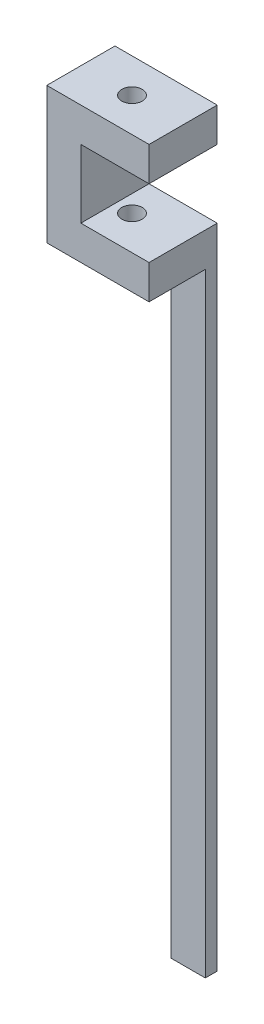
ISO-10303-21;
HEADER;
FILE_DESCRIPTION(('STEP AP214'),'2;1');
FILE_NAME('part.step','',(''),(''),'','','');
FILE_SCHEMA(('AUTOMOTIVE_DESIGN { 1 0 10303 214 1 1 1 1 }'));
ENDSEC;
DATA;
#1=APPLICATION_CONTEXT('core data for automotive mechanical design processes');
#2=APPLICATION_PROTOCOL_DEFINITION('international standard','automotive_design',2000,#1);
#3=PRODUCT_CONTEXT('',#1,'mechanical');
#4=PRODUCT('Part','Part','',(#3));
#5=PRODUCT_RELATED_PRODUCT_CATEGORY('part','',(#4));
#6=PRODUCT_DEFINITION_FORMATION('','',#4);
#7=PRODUCT_DEFINITION_CONTEXT('part definition',#1,'design');
#8=PRODUCT_DEFINITION('design','',#6,#7);
#9=PRODUCT_DEFINITION_SHAPE('','',#8);
#10=(LENGTH_UNIT() NAMED_UNIT(*) SI_UNIT(.MILLI.,.METRE.));
#11=(NAMED_UNIT(*) PLANE_ANGLE_UNIT() SI_UNIT($,.RADIAN.));
#12=(NAMED_UNIT(*) SI_UNIT($,.STERADIAN.) SOLID_ANGLE_UNIT());
#13=UNCERTAINTY_MEASURE_WITH_UNIT(LENGTH_MEASURE(1.E-05),#10,'distance_accuracy_value','');
#14=(GEOMETRIC_REPRESENTATION_CONTEXT(3) GLOBAL_UNCERTAINTY_ASSIGNED_CONTEXT((#13)) GLOBAL_UNIT_ASSIGNED_CONTEXT((#10,
#11,#12)) REPRESENTATION_CONTEXT('',''));
#15=CARTESIAN_POINT('',(0.,0.,0.));
#16=DIRECTION('',(0.,0.,1.));
#17=DIRECTION('',(1.,0.,0.));
#18=AXIS2_PLACEMENT_3D('',#15,#16,#17);
#19=CARTESIAN_POINT('',(0.,-9.18809518970519,10.));
#20=DIRECTION('',(0.,1.,0.));
#21=DIRECTION('',(0.,0.,1.));
#22=AXIS2_PLACEMENT_3D('',#19,#20,#21);
#23=PLANE('',#22);
#24=CARTESIAN_POINT('',(7.5,-9.18809518970519,5.));
#25=DIRECTION('',(0.,1.,0.));
#26=DIRECTION('',(0.,0.,1.));
#27=AXIS2_PLACEMENT_3D('',#24,#25,#26);
#28=CIRCLE('',#27,1.5);
#29=CARTESIAN_POINT('',(7.5,-9.18809518970519,6.5));
#30=VERTEX_POINT('',#29);
#31=EDGE_CURVE('E248',#30,#30,#28,.T.);
#32=ORIENTED_EDGE('',*,*,#31,.T.);
#33=EDGE_LOOP('',(#32));
#34=FACE_BOUND('',#33,.T.);
#35=DIRECTION('',(0.,0.,-1.));
#36=VECTOR('',#35,1.);
#37=CARTESIAN_POINT('',(10.,-9.18809518970519,0.));
#38=LINE('',#37,#36);
#39=CARTESIAN_POINT('',(10.,-9.18809518970519,1.75));
#40=VERTEX_POINT('',#39);
#41=CARTESIAN_POINT('',(10.,-9.18809518970519,0.));
#42=VERTEX_POINT('',#41);
#43=EDGE_CURVE('E148',#40,#42,#38,.T.);
#44=ORIENTED_EDGE('',*,*,#43,.F.);
#45=DIRECTION('',(-1.,0.,0.));
#46=VECTOR('',#45,1.);
#47=CARTESIAN_POINT('',(15.,-9.18809518970519,1.75));
#48=LINE('',#47,#46);
#49=CARTESIAN_POINT('',(15.,-9.18809518970519,1.75));
#50=VERTEX_POINT('',#49);
#51=EDGE_CURVE('E59',#50,#40,#48,.T.);
#52=ORIENTED_EDGE('',*,*,#51,.F.);
#53=DIRECTION('',(0.,0.,-1.));
#54=VECTOR('',#53,1.);
#55=CARTESIAN_POINT('',(15.,-9.18809518970519,10.));
#56=LINE('',#55,#54);
#57=CARTESIAN_POINT('',(15.,-9.18809518970519,10.));
#58=VERTEX_POINT('',#57);
#59=EDGE_CURVE('E152',#58,#50,#56,.T.);
#60=ORIENTED_EDGE('',*,*,#59,.F.);
#61=DIRECTION('',(1.,0.,0.));
#62=VECTOR('',#61,1.);
#63=CARTESIAN_POINT('',(0.,-9.18809518970519,10.));
#64=LINE('',#63,#62);
#65=CARTESIAN_POINT('',(0.,-9.18809518970519,10.));
#66=VERTEX_POINT('',#65);
#67=EDGE_CURVE('E173',#66,#58,#64,.T.);
#68=ORIENTED_EDGE('',*,*,#67,.F.);
#69=DIRECTION('',(0.,0.,-1.));
#70=VECTOR('',#69,1.);
#71=CARTESIAN_POINT('',(0.,-9.18809518970519,10.));
#72=LINE('',#71,#70);
#73=CARTESIAN_POINT('',(0.,-9.18809518970519,0.));
#74=VERTEX_POINT('',#73);
#75=EDGE_CURVE('E52',#66,#74,#72,.T.);
#76=ORIENTED_EDGE('',*,*,#75,.T.);
#77=DIRECTION('',(1.,0.,0.));
#78=VECTOR('',#77,1.);
#79=CARTESIAN_POINT('',(0.,-9.18809518970519,0.));
#80=LINE('',#79,#78);
#81=EDGE_CURVE('E65',#74,#42,#80,.T.);
#82=ORIENTED_EDGE('',*,*,#81,.T.);
#83=EDGE_LOOP('',(#44,#52,#60,#68,#76,#82));
#84=FACE_BOUND('',#83,.T.);
#85=ADVANCED_FACE('F42',(#34,#84),#23,.F.);
#86=CARTESIAN_POINT('',(0.,10.8119048102948,10.));
#87=DIRECTION('',(0.,-1.,0.));
#88=DIRECTION('',(0.,0.,-1.));
#89=AXIS2_PLACEMENT_3D('',#86,#87,#88);
#90=PLANE('',#89);
#91=CARTESIAN_POINT('',(7.5,10.8119048102948,5.));
#92=DIRECTION('',(0.,1.,0.));
#93=DIRECTION('',(0.,0.,1.));
#94=AXIS2_PLACEMENT_3D('',#91,#92,#93);
#95=CIRCLE('',#94,1.5);
#96=CARTESIAN_POINT('',(7.5,10.8119048102948,6.5));
#97=VERTEX_POINT('',#96);
#98=EDGE_CURVE('E259',#97,#97,#95,.T.);
#99=ORIENTED_EDGE('',*,*,#98,.F.);
#100=EDGE_LOOP('',(#99));
#101=FACE_BOUND('',#100,.T.);
#102=DIRECTION('',(-1.,0.,0.));
#103=VECTOR('',#102,1.);
#104=CARTESIAN_POINT('',(0.,10.8119048102948,0.));
#105=LINE('',#104,#103);
#106=CARTESIAN_POINT('',(15.,10.8119048102948,0.));
#107=VERTEX_POINT('',#106);
#108=CARTESIAN_POINT('',(0.,10.8119048102948,0.));
#109=VERTEX_POINT('',#108);
#110=EDGE_CURVE('E154',#107,#109,#105,.T.);
#111=ORIENTED_EDGE('',*,*,#110,.T.);
#112=DIRECTION('',(0.,0.,-1.));
#113=VECTOR('',#112,1.);
#114=CARTESIAN_POINT('',(0.,10.8119048102948,10.));
#115=LINE('',#114,#113);
#116=CARTESIAN_POINT('',(0.,10.8119048102948,10.));
#117=VERTEX_POINT('',#116);
#118=EDGE_CURVE('E11',#117,#109,#115,.T.);
#119=ORIENTED_EDGE('',*,*,#118,.F.);
#120=DIRECTION('',(-1.,0.,0.));
#121=VECTOR('',#120,1.);
#122=CARTESIAN_POINT('',(0.,10.8119048102948,10.));
#123=LINE('',#122,#121);
#124=CARTESIAN_POINT('',(15.,10.8119048102948,10.));
#125=VERTEX_POINT('',#124);
#126=EDGE_CURVE('E165',#125,#117,#123,.T.);
#127=ORIENTED_EDGE('',*,*,#126,.F.);
#128=DIRECTION('',(0.,0.,-1.));
#129=VECTOR('',#128,1.);
#130=CARTESIAN_POINT('',(15.,10.8119048102948,10.));
#131=LINE('',#130,#129);
#132=EDGE_CURVE('E190',#125,#107,#131,.T.);
#133=ORIENTED_EDGE('',*,*,#132,.T.);
#134=EDGE_LOOP('',(#111,#119,#127,#133));
#135=FACE_BOUND('',#134,.T.);
#136=ADVANCED_FACE('F44',(#101,#135),#90,.F.);
#137=CARTESIAN_POINT('',(0.,10.8119048102948,10.));
#138=DIRECTION('',(1.,0.,0.));
#139=DIRECTION('',(0.,1.,0.));
#140=AXIS2_PLACEMENT_3D('',#137,#138,#139);
#141=PLANE('',#140);
#142=DIRECTION('',(0.,-1.,0.));
#143=VECTOR('',#142,1.);
#144=CARTESIAN_POINT('',(0.,10.8119048102948,0.));
#145=LINE('',#144,#143);
#146=EDGE_CURVE('E159',#109,#74,#145,.T.);
#147=ORIENTED_EDGE('',*,*,#146,.T.);
#148=ORIENTED_EDGE('',*,*,#75,.F.);
#149=DIRECTION('',(0.,-1.,0.));
#150=VECTOR('',#149,1.);
#151=CARTESIAN_POINT('',(0.,10.8119048102948,10.));
#152=LINE('',#151,#150);
#153=EDGE_CURVE('E169',#117,#66,#152,.T.);
#154=ORIENTED_EDGE('',*,*,#153,.F.);
#155=ORIENTED_EDGE('',*,*,#118,.T.);
#156=EDGE_LOOP('',(#147,#148,#154,#155));
#157=FACE_BOUND('',#156,.T.);
#158=ADVANCED_FACE('F289',(#157),#141,.F.);
#159=CARTESIAN_POINT('',(15.,-9.18809518970519,10.));
#160=DIRECTION('',(-1.,0.,0.));
#161=DIRECTION('',(0.,-1.,0.));
#162=AXIS2_PLACEMENT_3D('',#159,#160,#161);
#163=PLANE('',#162);
#164=DIRECTION('',(0.,1.,0.));
#165=VECTOR('',#164,1.);
#166=CARTESIAN_POINT('',(15.,-9.18809518970519,0.));
#167=LINE('',#166,#165);
#168=CARTESIAN_POINT('',(15.,-99.1880951897052,0.));
#169=VERTEX_POINT('',#168);
#170=CARTESIAN_POINT('',(15.,-4.18809518970519,0.));
#171=VERTEX_POINT('',#170);
#172=EDGE_CURVE('E196',#169,#171,#167,.T.);
#173=ORIENTED_EDGE('',*,*,#172,.T.);
#174=DIRECTION('',(0.,0.,-1.));
#175=VECTOR('',#174,1.);
#176=CARTESIAN_POINT('',(15.,-4.18809518970519,10.));
#177=LINE('',#176,#175);
#178=CARTESIAN_POINT('',(15.,-4.18809518970519,10.));
#179=VERTEX_POINT('',#178);
#180=EDGE_CURVE('E225',#179,#171,#177,.T.);
#181=ORIENTED_EDGE('',*,*,#180,.F.);
#182=DIRECTION('',(0.,1.,0.));
#183=VECTOR('',#182,1.);
#184=CARTESIAN_POINT('',(15.,-9.18809518970519,10.));
#185=LINE('',#184,#183);
#186=EDGE_CURVE('E176',#58,#179,#185,.T.);
#187=ORIENTED_EDGE('',*,*,#186,.F.);
#188=ORIENTED_EDGE('',*,*,#59,.T.);
#189=DIRECTION('',(0.,1.,0.));
#190=VECTOR('',#189,1.);
#191=CARTESIAN_POINT('',(15.,-99.1880951897052,1.75));
#192=LINE('',#191,#190);
#193=CARTESIAN_POINT('',(15.,-99.1880951897052,1.75));
#194=VERTEX_POINT('',#193);
#195=EDGE_CURVE('E132',#194,#50,#192,.T.);
#196=ORIENTED_EDGE('',*,*,#195,.F.);
#197=DIRECTION('',(0.,0.,1.));
#198=VECTOR('',#197,1.);
#199=CARTESIAN_POINT('',(15.,-99.1880951897052,0.));
#200=LINE('',#199,#198);
#201=EDGE_CURVE('E139',#169,#194,#200,.T.);
#202=ORIENTED_EDGE('',*,*,#201,.F.);
#203=EDGE_LOOP('',(#173,#181,#187,#188,#196,#202));
#204=FACE_BOUND('',#203,.T.);
#205=ADVANCED_FACE('F150',(#204),#163,.F.);
#206=CARTESIAN_POINT('',(15.,-4.18809518970519,10.));
#207=DIRECTION('',(0.,-1.,0.));
#208=DIRECTION('',(0.,0.,-1.));
#209=AXIS2_PLACEMENT_3D('',#206,#207,#208);
#210=PLANE('',#209);
#211=CARTESIAN_POINT('',(7.5,-4.1880951897052,5.));
#212=DIRECTION('',(0.,-1.,0.));
#213=DIRECTION('',(0.,0.,-1.));
#214=AXIS2_PLACEMENT_3D('',#211,#212,#213);
#215=CIRCLE('',#214,1.5);
#216=CARTESIAN_POINT('',(7.5,-4.1880951897052,3.5));
#217=VERTEX_POINT('',#216);
#218=EDGE_CURVE('E255',#217,#217,#215,.T.);
#219=ORIENTED_EDGE('',*,*,#218,.T.);
#220=EDGE_LOOP('',(#219));
#221=FACE_BOUND('',#220,.T.);
#222=DIRECTION('',(-1.,0.,0.));
#223=VECTOR('',#222,1.);
#224=CARTESIAN_POINT('',(15.,-4.18809518970519,0.));
#225=LINE('',#224,#223);
#226=CARTESIAN_POINT('',(5.,-4.18809518970519,0.));
#227=VERTEX_POINT('',#226);
#228=EDGE_CURVE('E199',#171,#227,#225,.T.);
#229=ORIENTED_EDGE('',*,*,#228,.T.);
#230=DIRECTION('',(0.,0.,-1.));
#231=VECTOR('',#230,1.);
#232=CARTESIAN_POINT('',(5.,-4.18809518970519,10.));
#233=LINE('',#232,#231);
#234=CARTESIAN_POINT('',(5.,-4.18809518970519,10.));
#235=VERTEX_POINT('',#234);
#236=EDGE_CURVE('E221',#235,#227,#233,.T.);
#237=ORIENTED_EDGE('',*,*,#236,.F.);
#238=DIRECTION('',(-1.,0.,0.));
#239=VECTOR('',#238,1.);
#240=CARTESIAN_POINT('',(15.,-4.18809518970519,10.));
#241=LINE('',#240,#239);
#242=EDGE_CURVE('E179',#179,#235,#241,.T.);
#243=ORIENTED_EDGE('',*,*,#242,.F.);
#244=ORIENTED_EDGE('',*,*,#180,.T.);
#245=EDGE_LOOP('',(#229,#237,#243,#244));
#246=FACE_BOUND('',#245,.T.);
#247=ADVANCED_FACE('F298',(#221,#246),#210,.F.);
#248=CARTESIAN_POINT('',(5.,5.81190481029481,10.));
#249=DIRECTION('',(-1.,0.,0.));
#250=DIRECTION('',(0.,-1.,0.));
#251=AXIS2_PLACEMENT_3D('',#248,#249,#250);
#252=PLANE('',#251);
#253=DIRECTION('',(0.,1.,0.));
#254=VECTOR('',#253,1.);
#255=CARTESIAN_POINT('',(5.,5.81190481029481,0.));
#256=LINE('',#255,#254);
#257=CARTESIAN_POINT('',(5.,5.81190481029481,0.));
#258=VERTEX_POINT('',#257);
#259=EDGE_CURVE('E202',#227,#258,#256,.T.);
#260=ORIENTED_EDGE('',*,*,#259,.T.);
#261=DIRECTION('',(0.,0.,-1.));
#262=VECTOR('',#261,1.);
#263=CARTESIAN_POINT('',(5.,5.81190481029481,10.));
#264=LINE('',#263,#262);
#265=CARTESIAN_POINT('',(5.,5.81190481029481,10.));
#266=VERTEX_POINT('',#265);
#267=EDGE_CURVE('E217',#266,#258,#264,.T.);
#268=ORIENTED_EDGE('',*,*,#267,.F.);
#269=DIRECTION('',(0.,1.,0.));
#270=VECTOR('',#269,1.);
#271=CARTESIAN_POINT('',(5.,5.81190481029481,10.));
#272=LINE('',#271,#270);
#273=EDGE_CURVE('E182',#235,#266,#272,.T.);
#274=ORIENTED_EDGE('',*,*,#273,.F.);
#275=ORIENTED_EDGE('',*,*,#236,.T.);
#276=EDGE_LOOP('',(#260,#268,#274,#275));
#277=FACE_BOUND('',#276,.T.);
#278=ADVANCED_FACE('F314',(#277),#252,.F.);
#279=CARTESIAN_POINT('',(15.,5.81190481029481,10.));
#280=DIRECTION('',(0.,1.,0.));
#281=DIRECTION('',(-1.,0.,0.));
#282=AXIS2_PLACEMENT_3D('',#279,#280,#281);
#283=PLANE('',#282);
#284=CARTESIAN_POINT('',(7.5,5.81190481029481,5.));
#285=DIRECTION('',(0.,1.,0.));
#286=DIRECTION('',(-1.,0.,0.));
#287=AXIS2_PLACEMENT_3D('',#284,#285,#286);
#288=CIRCLE('',#287,1.5);
#289=CARTESIAN_POINT('',(6.,5.81190481029481,5.));
#290=VERTEX_POINT('',#289);
#291=EDGE_CURVE('E46',#290,#290,#288,.T.);
#292=ORIENTED_EDGE('',*,*,#291,.T.);
#293=EDGE_LOOP('',(#292));
#294=FACE_BOUND('',#293,.T.);
#295=DIRECTION('',(1.,0.,0.));
#296=VECTOR('',#295,1.);
#297=CARTESIAN_POINT('',(15.,5.81190481029481,0.));
#298=LINE('',#297,#296);
#299=CARTESIAN_POINT('',(15.,5.81190481029481,0.));
#300=VERTEX_POINT('',#299);
#301=EDGE_CURVE('E205',#258,#300,#298,.T.);
#302=ORIENTED_EDGE('',*,*,#301,.T.);
#303=DIRECTION('',(0.,0.,-1.));
#304=VECTOR('',#303,1.);
#305=CARTESIAN_POINT('',(15.,5.81190481029481,10.));
#306=LINE('',#305,#304);
#307=CARTESIAN_POINT('',(15.,5.81190481029481,10.));
#308=VERTEX_POINT('',#307);
#309=EDGE_CURVE('E213',#308,#300,#306,.T.);
#310=ORIENTED_EDGE('',*,*,#309,.F.);
#311=DIRECTION('',(1.,0.,0.));
#312=VECTOR('',#311,1.);
#313=CARTESIAN_POINT('',(15.,5.81190481029481,10.));
#314=LINE('',#313,#312);
#315=EDGE_CURVE('E185',#266,#308,#314,.T.);
#316=ORIENTED_EDGE('',*,*,#315,.F.);
#317=ORIENTED_EDGE('',*,*,#267,.T.);
#318=EDGE_LOOP('',(#302,#310,#316,#317));
#319=FACE_BOUND('',#318,.T.);
#320=ADVANCED_FACE('F268',(#294,#319),#283,.F.);
#321=CARTESIAN_POINT('',(15.,10.8119048102948,10.));
#322=DIRECTION('',(-1.,0.,0.));
#323=DIRECTION('',(0.,-1.,0.));
#324=AXIS2_PLACEMENT_3D('',#321,#322,#323);
#325=PLANE('',#324);
#326=DIRECTION('',(0.,1.,0.));
#327=VECTOR('',#326,1.);
#328=CARTESIAN_POINT('',(15.,10.8119048102948,0.));
#329=LINE('',#328,#327);
#330=EDGE_CURVE('E170',#300,#107,#329,.T.);
#331=ORIENTED_EDGE('',*,*,#330,.T.);
#332=ORIENTED_EDGE('',*,*,#132,.F.);
#333=DIRECTION('',(0.,1.,0.));
#334=VECTOR('',#333,1.);
#335=CARTESIAN_POINT('',(15.,10.8119048102948,10.));
#336=LINE('',#335,#334);
#337=EDGE_CURVE('E188',#308,#125,#336,.T.);
#338=ORIENTED_EDGE('',*,*,#337,.F.);
#339=ORIENTED_EDGE('',*,*,#309,.T.);
#340=EDGE_LOOP('',(#331,#332,#338,#339));
#341=FACE_BOUND('',#340,.T.);
#342=ADVANCED_FACE('F307',(#341),#325,.F.);
#343=CARTESIAN_POINT('',(0.,0.,10.));
#344=DIRECTION('',(0.,0.,-1.));
#345=DIRECTION('',(-1.,0.,0.));
#346=AXIS2_PLACEMENT_3D('',#343,#344,#345);
#347=PLANE('',#346);
#348=ORIENTED_EDGE('',*,*,#126,.T.);
#349=ORIENTED_EDGE('',*,*,#153,.T.);
#350=ORIENTED_EDGE('',*,*,#67,.T.);
#351=ORIENTED_EDGE('',*,*,#186,.T.);
#352=ORIENTED_EDGE('',*,*,#242,.T.);
#353=ORIENTED_EDGE('',*,*,#273,.T.);
#354=ORIENTED_EDGE('',*,*,#315,.T.);
#355=ORIENTED_EDGE('',*,*,#337,.T.);
#356=EDGE_LOOP('',(#348,#349,#350,#351,#352,#353,#354,#355));
#357=FACE_BOUND('',#356,.T.);
#358=ADVANCED_FACE('F321',(#357),#347,.F.);
#359=CARTESIAN_POINT('',(0.,0.,0.));
#360=DIRECTION('',(0.,0.,-1.));
#361=DIRECTION('',(-1.,0.,0.));
#362=AXIS2_PLACEMENT_3D('',#359,#360,#361);
#363=PLANE('',#362);
#364=ORIENTED_EDGE('',*,*,#110,.F.);
#365=ORIENTED_EDGE('',*,*,#330,.F.);
#366=ORIENTED_EDGE('',*,*,#301,.F.);
#367=ORIENTED_EDGE('',*,*,#259,.F.);
#368=ORIENTED_EDGE('',*,*,#228,.F.);
#369=ORIENTED_EDGE('',*,*,#172,.F.);
#370=DIRECTION('',(1.,0.,0.));
#371=VECTOR('',#370,1.);
#372=CARTESIAN_POINT('',(15.,-99.1880951897052,0.));
#373=LINE('',#372,#371);
#374=CARTESIAN_POINT('',(10.,-99.1880951897052,0.));
#375=VERTEX_POINT('',#374);
#376=EDGE_CURVE('E145',#375,#169,#373,.T.);
#377=ORIENTED_EDGE('',*,*,#376,.F.);
#378=DIRECTION('',(0.,1.,0.));
#379=VECTOR('',#378,1.);
#380=CARTESIAN_POINT('',(10.,-99.1880951897052,0.));
#381=LINE('',#380,#379);
#382=EDGE_CURVE('E161',#375,#42,#381,.T.);
#383=ORIENTED_EDGE('',*,*,#382,.T.);
#384=ORIENTED_EDGE('',*,*,#81,.F.);
#385=ORIENTED_EDGE('',*,*,#146,.F.);
#386=EDGE_LOOP('',(#364,#365,#366,#367,#368,#369,#377,#383,#384,#385));
#387=FACE_BOUND('',#386,.T.);
#388=ADVANCED_FACE('F238',(#387),#363,.T.);
#389=CARTESIAN_POINT('',(15.,-99.1880951897052,1.75));
#390=DIRECTION('',(0.,0.,-1.));
#391=DIRECTION('',(-1.,0.,0.));
#392=AXIS2_PLACEMENT_3D('',#389,#390,#391);
#393=PLANE('',#392);
#394=ORIENTED_EDGE('',*,*,#51,.T.);
#395=DIRECTION('',(0.,1.,0.));
#396=VECTOR('',#395,1.);
#397=CARTESIAN_POINT('',(10.,-99.1880951897052,1.75));
#398=LINE('',#397,#396);
#399=CARTESIAN_POINT('',(10.,-99.1880951897052,1.75));
#400=VERTEX_POINT('',#399);
#401=EDGE_CURVE('E134',#400,#40,#398,.T.);
#402=ORIENTED_EDGE('',*,*,#401,.F.);
#403=DIRECTION('',(-1.,0.,0.));
#404=VECTOR('',#403,1.);
#405=CARTESIAN_POINT('',(15.,-99.1880951897052,1.75));
#406=LINE('',#405,#404);
#407=EDGE_CURVE('E128',#194,#400,#406,.T.);
#408=ORIENTED_EDGE('',*,*,#407,.F.);
#409=ORIENTED_EDGE('',*,*,#195,.T.);
#410=EDGE_LOOP('',(#394,#402,#408,#409));
#411=FACE_BOUND('',#410,.T.);
#412=ADVANCED_FACE('F130',(#411),#393,.F.);
#413=CARTESIAN_POINT('',(10.,-99.1880951897052,0.));
#414=DIRECTION('',(1.,0.,0.));
#415=DIRECTION('',(0.,0.,-1.));
#416=AXIS2_PLACEMENT_3D('',#413,#414,#415);
#417=PLANE('',#416);
#418=ORIENTED_EDGE('',*,*,#43,.T.);
#419=ORIENTED_EDGE('',*,*,#382,.F.);
#420=DIRECTION('',(0.,0.,-1.));
#421=VECTOR('',#420,1.);
#422=CARTESIAN_POINT('',(10.,-99.1880951897052,0.));
#423=LINE('',#422,#421);
#424=EDGE_CURVE('E138',#400,#375,#423,.T.);
#425=ORIENTED_EDGE('',*,*,#424,.F.);
#426=ORIENTED_EDGE('',*,*,#401,.T.);
#427=EDGE_LOOP('',(#418,#419,#425,#426));
#428=FACE_BOUND('',#427,.T.);
#429=ADVANCED_FACE('F280',(#428),#417,.F.);
#430=CARTESIAN_POINT('',(0.,-99.1880951897052,0.));
#431=DIRECTION('',(0.,-1.,0.));
#432=DIRECTION('',(0.,0.,-1.));
#433=AXIS2_PLACEMENT_3D('',#430,#431,#432);
#434=PLANE('',#433);
#435=ORIENTED_EDGE('',*,*,#201,.T.);
#436=ORIENTED_EDGE('',*,*,#407,.T.);
#437=ORIENTED_EDGE('',*,*,#424,.T.);
#438=ORIENTED_EDGE('',*,*,#376,.T.);
#439=EDGE_LOOP('',(#435,#436,#437,#438));
#440=FACE_BOUND('',#439,.T.);
#441=ADVANCED_FACE('F143',(#440),#434,.T.);
#442=CARTESIAN_POINT('',(7.5,-99.1880951897052,5.));
#443=DIRECTION('',(0.,1.,0.));
#444=DIRECTION('',(0.,0.,1.));
#445=AXIS2_PLACEMENT_3D('',#442,#443,#444);
#446=CYLINDRICAL_SURFACE('',#445,1.5);
#447=ORIENTED_EDGE('',*,*,#98,.T.);
#448=EDGE_LOOP('',(#447));
#449=FACE_BOUND('',#448,.T.);
#450=ORIENTED_EDGE('',*,*,#291,.F.);
#451=EDGE_LOOP('',(#450));
#452=FACE_BOUND('',#451,.T.);
#453=ADVANCED_FACE('F271',(#449,#452),#446,.F.);
#454=ORIENTED_EDGE('',*,*,#218,.F.);
#455=EDGE_LOOP('',(#454));
#456=FACE_BOUND('',#455,.T.);
#457=ORIENTED_EDGE('',*,*,#31,.F.);
#458=EDGE_LOOP('',(#457));
#459=FACE_BOUND('',#458,.T.);
#460=ADVANCED_FACE('F273',(#456,#459),#446,.F.);
#461=CLOSED_SHELL('',(#85,#136,#158,#205,#247,#278,#320,#342,#358,#388,#412,#429,#441,#453,#460));
#462=MANIFOLD_SOLID_BREP('B2',#461);
#463=ADVANCED_BREP_SHAPE_REPRESENTATION('',(#18,#462),#14);
#464=SHAPE_DEFINITION_REPRESENTATION(#9,#463);
ENDSEC;
END-ISO-10303-21;
